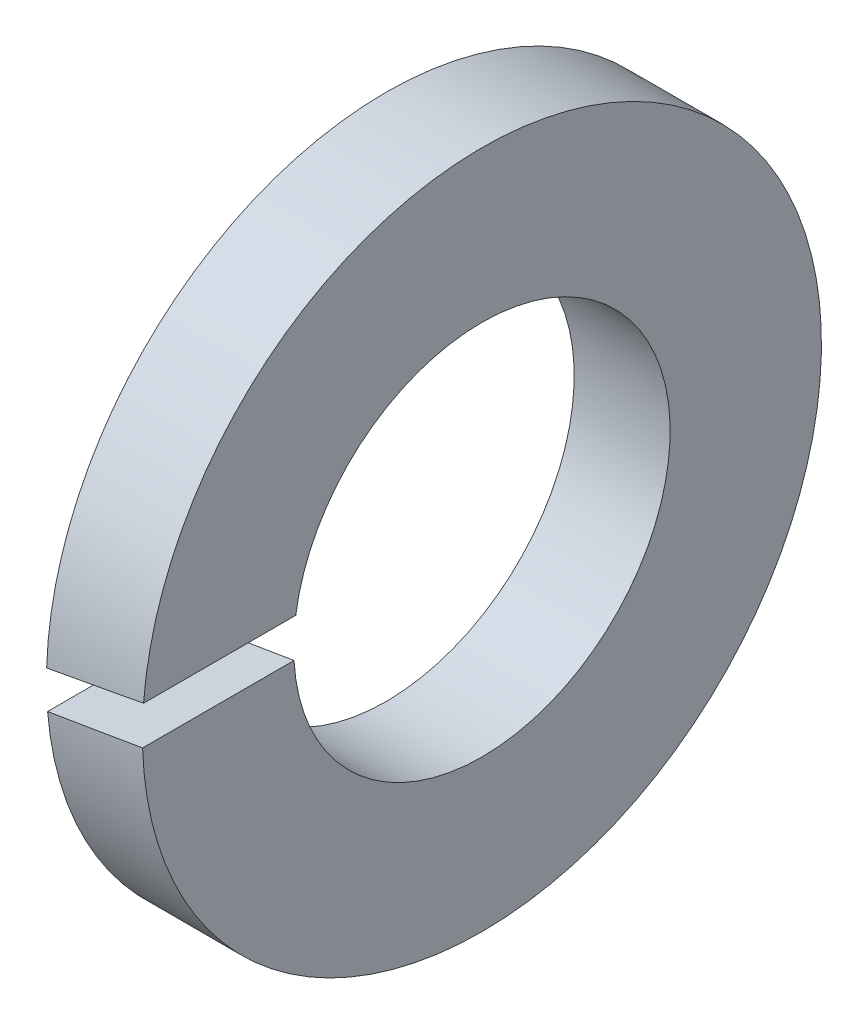
ISO-10303-21;
HEADER;
FILE_DESCRIPTION(('STEP AP214'),'2;1');
FILE_NAME('part.step','',(''),(''),'','','');
FILE_SCHEMA(('AUTOMOTIVE_DESIGN { 1 0 10303 214 1 1 1 1 }'));
ENDSEC;
DATA;
#1=APPLICATION_CONTEXT('core data for automotive mechanical design processes');
#2=APPLICATION_PROTOCOL_DEFINITION('international standard','automotive_design',2000,#1);
#3=PRODUCT_CONTEXT('',#1,'mechanical');
#4=PRODUCT('Part','Part','',(#3));
#5=PRODUCT_RELATED_PRODUCT_CATEGORY('part','',(#4));
#6=PRODUCT_DEFINITION_FORMATION('','',#4);
#7=PRODUCT_DEFINITION_CONTEXT('part definition',#1,'design');
#8=PRODUCT_DEFINITION('design','',#6,#7);
#9=PRODUCT_DEFINITION_SHAPE('','',#8);
#10=(LENGTH_UNIT() NAMED_UNIT(*) SI_UNIT(.MILLI.,.METRE.));
#11=(NAMED_UNIT(*) PLANE_ANGLE_UNIT() SI_UNIT($,.RADIAN.));
#12=(NAMED_UNIT(*) SI_UNIT($,.STERADIAN.) SOLID_ANGLE_UNIT());
#13=UNCERTAINTY_MEASURE_WITH_UNIT(LENGTH_MEASURE(1.E-05),#10,'distance_accuracy_value','');
#14=(GEOMETRIC_REPRESENTATION_CONTEXT(3) GLOBAL_UNCERTAINTY_ASSIGNED_CONTEXT((#13)) GLOBAL_UNIT_ASSIGNED_CONTEXT((#10,
#11,#12)) REPRESENTATION_CONTEXT('',''));
#15=CARTESIAN_POINT('',(0.,0.,0.));
#16=DIRECTION('',(0.,0.,1.));
#17=DIRECTION('',(1.,0.,0.));
#18=AXIS2_PLACEMENT_3D('',#15,#16,#17);
#19=CARTESIAN_POINT('',(0.65,3.575,0.));
#20=DIRECTION('',(1.,0.,0.));
#21=DIRECTION('',(0.,0.,-1.));
#22=AXIS2_PLACEMENT_3D('',#19,#20,#21);
#23=PLANE('',#22);
#24=CARTESIAN_POINT('',(0.65,0.,0.));
#25=DIRECTION('',(1.,0.,0.));
#26=DIRECTION('',(0.,0.,-1.));
#27=AXIS2_PLACEMENT_3D('',#24,#25,#26);
#28=CIRCLE('',#27,4.6);
#29=CARTESIAN_POINT('',(0.65,0.373546323491367,4.58480786339036));
#30=VERTEX_POINT('',#29);
#31=CARTESIAN_POINT('',(0.65,-0.144321248570363,4.59773546185631));
#32=VERTEX_POINT('',#31);
#33=EDGE_CURVE('E67',#30,#32,#28,.F.);
#34=ORIENTED_EDGE('',*,*,#33,.F.);
#35=DIRECTION('',(0.,0.,1.));
#36=VECTOR('',#35,1.);
#37=CARTESIAN_POINT('',(0.650000000000001,0.373546323491367,0.));
#38=LINE('',#37,#36);
#39=CARTESIAN_POINT('',(0.65,0.373546323491367,2.52249145572509));
#40=VERTEX_POINT('',#39);
#41=EDGE_CURVE('E62',#30,#40,#38,.F.);
#42=ORIENTED_EDGE('',*,*,#41,.T.);
#43=CARTESIAN_POINT('',(0.65,0.,0.));
#44=DIRECTION('',(1.,0.,0.));
#45=DIRECTION('',(0.,0.,-1.));
#46=AXIS2_PLACEMENT_3D('',#43,#44,#45);
#47=CIRCLE('',#46,2.55);
#48=CARTESIAN_POINT('',(0.65,-0.144321248570363,2.54591268059435));
#49=VERTEX_POINT('',#48);
#50=EDGE_CURVE('E66',#40,#49,#47,.F.);
#51=ORIENTED_EDGE('',*,*,#50,.T.);
#52=DIRECTION('',(0.,0.,1.));
#53=VECTOR('',#52,1.);
#54=CARTESIAN_POINT('',(0.65,-0.144321248570363,0.));
#55=LINE('',#54,#53);
#56=EDGE_CURVE('E82',#49,#32,#55,.T.);
#57=ORIENTED_EDGE('',*,*,#56,.T.);
#58=EDGE_LOOP('',(#34,#42,#51,#57));
#59=FACE_BOUND('',#58,.T.);
#60=ADVANCED_FACE('F17',(#59),#23,.T.);
#61=CARTESIAN_POINT('',(-1.32453036422094,0.0253833460511036,0.));
#62=DIRECTION('',(-0.17364817766693,0.984807753012208,0.));
#63=DIRECTION('',(-0.984807753012208,-0.17364817766693,0.));
#64=AXIS2_PLACEMENT_3D('',#61,#62,#63);
#65=PLANE('',#64);
#66=CARTESIAN_POINT('',(-1.46848647320163,0.,0.));
#67=DIRECTION('',(-0.17364817766693,0.984807753012208,0.));
#68=DIRECTION('',(0.984807753012208,0.17364817766693,0.));
#69=AXIS2_PLACEMENT_3D('',#66,#67,#68);
#70=ELLIPSE('',#69,26.4903442224608,4.6);
#71=CARTESIAN_POINT('',(-0.65,0.144321248570363,4.59773546185631));
#72=VERTEX_POINT('',#71);
#73=EDGE_CURVE('E20',#72,#30,#70,.T.);
#74=ORIENTED_EDGE('',*,*,#73,.F.);
#75=DIRECTION('',(0.,0.,1.));
#76=VECTOR('',#75,1.);
#77=CARTESIAN_POINT('',(-0.65,0.144321248570363,0.));
#78=LINE('',#77,#76);
#79=CARTESIAN_POINT('',(-0.65,0.144321248570363,2.54591268059435));
#80=VERTEX_POINT('',#79);
#81=EDGE_CURVE('E72',#80,#72,#78,.T.);
#82=ORIENTED_EDGE('',*,*,#81,.F.);
#83=CARTESIAN_POINT('',(-1.46848647320163,0.,0.));
#84=DIRECTION('',(-0.17364817766693,0.984807753012208,0.));
#85=DIRECTION('',(0.984807753012208,0.17364817766693,0.));
#86=AXIS2_PLACEMENT_3D('',#83,#84,#85);
#87=ELLIPSE('',#86,14.6848647320163,2.55);
#88=EDGE_CURVE('E70',#80,#40,#87,.T.);
#89=ORIENTED_EDGE('',*,*,#88,.T.);
#90=ORIENTED_EDGE('',*,*,#41,.F.);
#91=EDGE_LOOP('',(#74,#82,#89,#90));
#92=FACE_BOUND('',#91,.T.);
#93=ADVANCED_FACE('F71',(#92),#65,.F.);
#94=CARTESIAN_POINT('',(0.,0.,0.));
#95=DIRECTION('',(1.,0.,0.));
#96=DIRECTION('',(0.,0.,-1.));
#97=AXIS2_PLACEMENT_3D('',#94,#95,#96);
#98=CYLINDRICAL_SURFACE('',#97,4.6);
#99=CARTESIAN_POINT('',(1.46848647320163,0.,0.));
#100=DIRECTION('',(0.17364817766693,-0.984807753012208,0.));
#101=DIRECTION('',(0.984807753012208,0.17364817766693,0.));
#102=AXIS2_PLACEMENT_3D('',#99,#100,#101);
#103=ELLIPSE('',#102,26.4903442224608,4.6);
#104=CARTESIAN_POINT('',(-0.65,-0.373546323491367,4.58480786339036));
#105=VERTEX_POINT('',#104);
#106=EDGE_CURVE('E83',#32,#105,#103,.T.);
#107=ORIENTED_EDGE('',*,*,#106,.T.);
#108=CARTESIAN_POINT('',(-0.65,0.,0.));
#109=DIRECTION('',(1.,0.,0.));
#110=DIRECTION('',(0.,0.,-1.));
#111=AXIS2_PLACEMENT_3D('',#108,#109,#110);
#112=CIRCLE('',#111,4.6);
#113=EDGE_CURVE('E77',#72,#105,#112,.F.);
#114=ORIENTED_EDGE('',*,*,#113,.F.);
#115=ORIENTED_EDGE('',*,*,#73,.T.);
#116=ORIENTED_EDGE('',*,*,#33,.T.);
#117=EDGE_LOOP('',(#107,#114,#115,#116));
#118=FACE_BOUND('',#117,.T.);
#119=ADVANCED_FACE('F86',(#118),#98,.T.);
#120=CARTESIAN_POINT('',(1.32453036422094,-0.0253833460511036,0.));
#121=DIRECTION('',(0.17364817766693,-0.984807753012208,0.));
#122=DIRECTION('',(0.984807753012208,0.17364817766693,0.));
#123=AXIS2_PLACEMENT_3D('',#120,#121,#122);
#124=PLANE('',#123);
#125=CARTESIAN_POINT('',(1.46848647320163,0.,0.));
#126=DIRECTION('',(0.17364817766693,-0.984807753012208,0.));
#127=DIRECTION('',(0.984807753012208,0.17364817766693,0.));
#128=AXIS2_PLACEMENT_3D('',#125,#126,#127);
#129=ELLIPSE('',#128,14.6848647320163,2.55);
#130=CARTESIAN_POINT('',(-0.65,-0.373546323491367,2.52249145572509));
#131=VERTEX_POINT('',#130);
#132=EDGE_CURVE('E35',#49,#131,#129,.T.);
#133=ORIENTED_EDGE('',*,*,#132,.T.);
#134=DIRECTION('',(0.,0.,1.));
#135=VECTOR('',#134,1.);
#136=CARTESIAN_POINT('',(-0.65,-0.373546323491367,0.));
#137=LINE('',#136,#135);
#138=EDGE_CURVE('E26',#105,#131,#137,.F.);
#139=ORIENTED_EDGE('',*,*,#138,.F.);
#140=ORIENTED_EDGE('',*,*,#106,.F.);
#141=ORIENTED_EDGE('',*,*,#56,.F.);
#142=EDGE_LOOP('',(#133,#139,#140,#141));
#143=FACE_BOUND('',#142,.T.);
#144=ADVANCED_FACE('F95',(#143),#124,.F.);
#145=CARTESIAN_POINT('',(0.,0.,0.));
#146=DIRECTION('',(1.,0.,0.));
#147=DIRECTION('',(0.,0.,-1.));
#148=AXIS2_PLACEMENT_3D('',#145,#146,#147);
#149=CYLINDRICAL_SURFACE('',#148,2.55);
#150=ORIENTED_EDGE('',*,*,#50,.F.);
#151=ORIENTED_EDGE('',*,*,#88,.F.);
#152=CARTESIAN_POINT('',(-0.65,0.,0.));
#153=DIRECTION('',(1.,0.,0.));
#154=DIRECTION('',(0.,0.,-1.));
#155=AXIS2_PLACEMENT_3D('',#152,#153,#154);
#156=CIRCLE('',#155,2.55);
#157=EDGE_CURVE('E11',#131,#80,#156,.T.);
#158=ORIENTED_EDGE('',*,*,#157,.F.);
#159=ORIENTED_EDGE('',*,*,#132,.F.);
#160=EDGE_LOOP('',(#150,#151,#158,#159));
#161=FACE_BOUND('',#160,.T.);
#162=ADVANCED_FACE('F75',(#161),#149,.F.);
#163=CARTESIAN_POINT('',(-0.65,3.575,0.));
#164=DIRECTION('',(-1.,0.,0.));
#165=DIRECTION('',(0.,0.,1.));
#166=AXIS2_PLACEMENT_3D('',#163,#164,#165);
#167=PLANE('',#166);
#168=ORIENTED_EDGE('',*,*,#157,.T.);
#169=ORIENTED_EDGE('',*,*,#81,.T.);
#170=ORIENTED_EDGE('',*,*,#113,.T.);
#171=ORIENTED_EDGE('',*,*,#138,.T.);
#172=EDGE_LOOP('',(#168,#169,#170,#171));
#173=FACE_BOUND('',#172,.T.);
#174=ADVANCED_FACE('F88',(#173),#167,.T.);
#175=CLOSED_SHELL('',(#60,#93,#119,#144,#162,#174));
#176=MANIFOLD_SOLID_BREP('B1',#175);
#177=ADVANCED_BREP_SHAPE_REPRESENTATION('',(#18,#176),#14);
#178=SHAPE_DEFINITION_REPRESENTATION(#9,#177);
ENDSEC;
END-ISO-10303-21;
